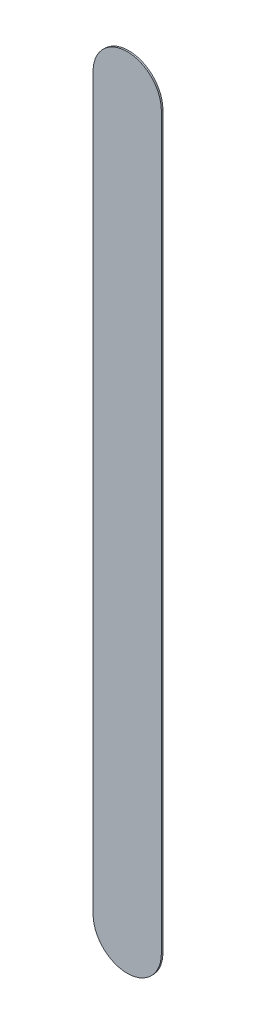
ISO-10303-21;
HEADER;
FILE_DESCRIPTION(('STEP AP214'),'2;1');
FILE_NAME('part.step','',(''),(''),'','','');
FILE_SCHEMA(('AUTOMOTIVE_DESIGN { 1 0 10303 214 1 1 1 1 }'));
ENDSEC;
DATA;
#1=APPLICATION_CONTEXT('core data for automotive mechanical design processes');
#2=APPLICATION_PROTOCOL_DEFINITION('international standard','automotive_design',2000,#1);
#3=PRODUCT_CONTEXT('',#1,'mechanical');
#4=PRODUCT('Part','Part','',(#3));
#5=PRODUCT_RELATED_PRODUCT_CATEGORY('part','',(#4));
#6=PRODUCT_DEFINITION_FORMATION('','',#4);
#7=PRODUCT_DEFINITION_CONTEXT('part definition',#1,'design');
#8=PRODUCT_DEFINITION('design','',#6,#7);
#9=PRODUCT_DEFINITION_SHAPE('','',#8);
#10=(LENGTH_UNIT() NAMED_UNIT(*) SI_UNIT(.MILLI.,.METRE.));
#11=(NAMED_UNIT(*) PLANE_ANGLE_UNIT() SI_UNIT($,.RADIAN.));
#12=(NAMED_UNIT(*) SI_UNIT($,.STERADIAN.) SOLID_ANGLE_UNIT());
#13=UNCERTAINTY_MEASURE_WITH_UNIT(LENGTH_MEASURE(1.E-05),#10,'distance_accuracy_value','');
#14=(GEOMETRIC_REPRESENTATION_CONTEXT(3) GLOBAL_UNCERTAINTY_ASSIGNED_CONTEXT((#13)) GLOBAL_UNIT_ASSIGNED_CONTEXT((#10,
#11,#12)) REPRESENTATION_CONTEXT('',''));
#15=CARTESIAN_POINT('',(0.,0.,0.));
#16=DIRECTION('',(0.,0.,1.));
#17=DIRECTION('',(1.,0.,0.));
#18=AXIS2_PLACEMENT_3D('',#15,#16,#17);
#19=CARTESIAN_POINT('',(153.682,-123.444,0.));
#20=DIRECTION('',(0.,0.,1.));
#21=DIRECTION('',(1.,0.,0.));
#22=AXIS2_PLACEMENT_3D('',#19,#20,#21);
#23=PLANE('',#22);
#24=DIRECTION('',(0.,-1.,0.));
#25=VECTOR('',#24,1.);
#26=CARTESIAN_POINT('',(153.682,-123.444,0.));
#27=LINE('',#26,#25);
#28=CARTESIAN_POINT('',(153.682,-123.444,0.));
#29=VERTEX_POINT('',#28);
#30=CARTESIAN_POINT('',(153.682,-139.488,0.));
#31=VERTEX_POINT('',#30);
#32=EDGE_CURVE('E80',#29,#31,#27,.T.);
#33=ORIENTED_EDGE('',*,*,#32,.T.);
#34=CARTESIAN_POINT('',(154.432,-139.488,0.));
#35=DIRECTION('',(0.,0.,1.));
#36=DIRECTION('',(-1.,0.,0.));
#37=AXIS2_PLACEMENT_3D('',#34,#35,#36);
#38=CIRCLE('',#37,0.75);
#39=CARTESIAN_POINT('',(155.182,-139.488,0.));
#40=VERTEX_POINT('',#39);
#41=EDGE_CURVE('E105',#31,#40,#38,.T.);
#42=ORIENTED_EDGE('',*,*,#41,.T.);
#43=DIRECTION('',(0.,1.,0.));
#44=VECTOR('',#43,1.);
#45=CARTESIAN_POINT('',(155.182,-139.488,0.));
#46=LINE('',#45,#44);
#47=CARTESIAN_POINT('',(155.182,-123.444,0.));
#48=VERTEX_POINT('',#47);
#49=EDGE_CURVE('E73',#40,#48,#46,.T.);
#50=ORIENTED_EDGE('',*,*,#49,.T.);
#51=CARTESIAN_POINT('',(154.432,-123.444,0.));
#52=DIRECTION('',(0.,0.,1.));
#53=DIRECTION('',(1.,0.,0.));
#54=AXIS2_PLACEMENT_3D('',#51,#52,#53);
#55=CIRCLE('',#54,0.75);
#56=EDGE_CURVE('E11',#48,#29,#55,.T.);
#57=ORIENTED_EDGE('',*,*,#56,.T.);
#58=EDGE_LOOP('',(#33,#42,#50,#57));
#59=FACE_BOUND('',#58,.T.);
#60=ADVANCED_FACE('F17',(#59),#23,.T.);
#61=CARTESIAN_POINT('',(153.682,-123.444,-0.035));
#62=DIRECTION('',(0.,0.,1.));
#63=DIRECTION('',(1.,0.,0.));
#64=AXIS2_PLACEMENT_3D('',#61,#62,#63);
#65=PLANE('',#64);
#66=CARTESIAN_POINT('',(154.432,-123.444,-0.035));
#67=DIRECTION('',(0.,0.,1.));
#68=DIRECTION('',(1.,0.,0.));
#69=AXIS2_PLACEMENT_3D('',#66,#67,#68);
#70=CIRCLE('',#69,0.75);
#71=CARTESIAN_POINT('',(155.182,-123.444,-0.035));
#72=VERTEX_POINT('',#71);
#73=CARTESIAN_POINT('',(153.682,-123.444,-0.035));
#74=VERTEX_POINT('',#73);
#75=EDGE_CURVE('E25',#72,#74,#70,.T.);
#76=ORIENTED_EDGE('',*,*,#75,.F.);
#77=DIRECTION('',(0.,1.,0.));
#78=VECTOR('',#77,1.);
#79=CARTESIAN_POINT('',(155.182,-139.488,-0.035));
#80=LINE('',#79,#78);
#81=CARTESIAN_POINT('',(155.182,-139.488,-0.035));
#82=VERTEX_POINT('',#81);
#83=EDGE_CURVE('E101',#82,#72,#80,.T.);
#84=ORIENTED_EDGE('',*,*,#83,.F.);
#85=CARTESIAN_POINT('',(154.432,-139.488,-0.035));
#86=DIRECTION('',(0.,0.,1.));
#87=DIRECTION('',(-1.,0.,0.));
#88=AXIS2_PLACEMENT_3D('',#85,#86,#87);
#89=CIRCLE('',#88,0.75);
#90=CARTESIAN_POINT('',(153.682,-139.488,-0.035));
#91=VERTEX_POINT('',#90);
#92=EDGE_CURVE('E82',#91,#82,#89,.T.);
#93=ORIENTED_EDGE('',*,*,#92,.F.);
#94=DIRECTION('',(0.,-1.,0.));
#95=VECTOR('',#94,1.);
#96=CARTESIAN_POINT('',(153.682,-123.444,-0.035));
#97=LINE('',#96,#95);
#98=EDGE_CURVE('E78',#74,#91,#97,.T.);
#99=ORIENTED_EDGE('',*,*,#98,.F.);
#100=EDGE_LOOP('',(#76,#84,#93,#99));
#101=FACE_BOUND('',#100,.T.);
#102=ADVANCED_FACE('F84',(#101),#65,.F.);
#103=CARTESIAN_POINT('',(154.432,-123.444,-0.035));
#104=DIRECTION('',(0.,0.,-1.));
#105=DIRECTION('',(1.,0.,0.));
#106=AXIS2_PLACEMENT_3D('',#103,#104,#105);
#107=CYLINDRICAL_SURFACE('',#106,0.75);
#108=ORIENTED_EDGE('',*,*,#75,.T.);
#109=DIRECTION('',(0.,0.,1.));
#110=VECTOR('',#109,1.);
#111=CARTESIAN_POINT('',(153.682,-123.444,-0.035));
#112=LINE('',#111,#110);
#113=EDGE_CURVE('E67',#74,#29,#112,.T.);
#114=ORIENTED_EDGE('',*,*,#113,.T.);
#115=ORIENTED_EDGE('',*,*,#56,.F.);
#116=DIRECTION('',(0.,0.,1.));
#117=VECTOR('',#116,1.);
#118=CARTESIAN_POINT('',(155.182,-123.444,-0.035));
#119=LINE('',#118,#117);
#120=EDGE_CURVE('E70',#72,#48,#119,.T.);
#121=ORIENTED_EDGE('',*,*,#120,.F.);
#122=EDGE_LOOP('',(#108,#114,#115,#121));
#123=FACE_BOUND('',#122,.T.);
#124=ADVANCED_FACE('F66',(#123),#107,.T.);
#125=CARTESIAN_POINT('',(155.182,-139.488,-0.035));
#126=DIRECTION('',(-1.,0.,0.));
#127=DIRECTION('',(0.,0.,1.));
#128=AXIS2_PLACEMENT_3D('',#125,#126,#127);
#129=PLANE('',#128);
#130=ORIENTED_EDGE('',*,*,#83,.T.);
#131=ORIENTED_EDGE('',*,*,#120,.T.);
#132=ORIENTED_EDGE('',*,*,#49,.F.);
#133=DIRECTION('',(0.,0.,1.));
#134=VECTOR('',#133,1.);
#135=CARTESIAN_POINT('',(155.182,-139.488,-0.035));
#136=LINE('',#135,#134);
#137=EDGE_CURVE('E104',#82,#40,#136,.T.);
#138=ORIENTED_EDGE('',*,*,#137,.F.);
#139=EDGE_LOOP('',(#130,#131,#132,#138));
#140=FACE_BOUND('',#139,.T.);
#141=ADVANCED_FACE('F117',(#140),#129,.F.);
#142=CARTESIAN_POINT('',(154.432,-139.488,-0.035));
#143=DIRECTION('',(0.,0.,-1.));
#144=DIRECTION('',(-1.,0.,0.));
#145=AXIS2_PLACEMENT_3D('',#142,#143,#144);
#146=CYLINDRICAL_SURFACE('',#145,0.75);
#147=ORIENTED_EDGE('',*,*,#92,.T.);
#148=ORIENTED_EDGE('',*,*,#137,.T.);
#149=ORIENTED_EDGE('',*,*,#41,.F.);
#150=DIRECTION('',(0.,0.,1.));
#151=VECTOR('',#150,1.);
#152=CARTESIAN_POINT('',(153.682,-139.488,-0.035));
#153=LINE('',#152,#151);
#154=EDGE_CURVE('E88',#91,#31,#153,.T.);
#155=ORIENTED_EDGE('',*,*,#154,.F.);
#156=EDGE_LOOP('',(#147,#148,#149,#155));
#157=FACE_BOUND('',#156,.T.);
#158=ADVANCED_FACE('F119',(#157),#146,.T.);
#159=CARTESIAN_POINT('',(153.682,-123.444,-0.035));
#160=DIRECTION('',(1.,0.,0.));
#161=DIRECTION('',(0.,1.,0.));
#162=AXIS2_PLACEMENT_3D('',#159,#160,#161);
#163=PLANE('',#162);
#164=ORIENTED_EDGE('',*,*,#98,.T.);
#165=ORIENTED_EDGE('',*,*,#154,.T.);
#166=ORIENTED_EDGE('',*,*,#32,.F.);
#167=ORIENTED_EDGE('',*,*,#113,.F.);
#168=EDGE_LOOP('',(#164,#165,#166,#167));
#169=FACE_BOUND('',#168,.T.);
#170=ADVANCED_FACE('F76',(#169),#163,.F.);
#171=CLOSED_SHELL('',(#60,#102,#124,#141,#158,#170));
#172=MANIFOLD_SOLID_BREP('B1',#171);
#173=ADVANCED_BREP_SHAPE_REPRESENTATION('',(#18,#172),#14);
#174=SHAPE_DEFINITION_REPRESENTATION(#9,#173);
ENDSEC;
END-ISO-10303-21;
